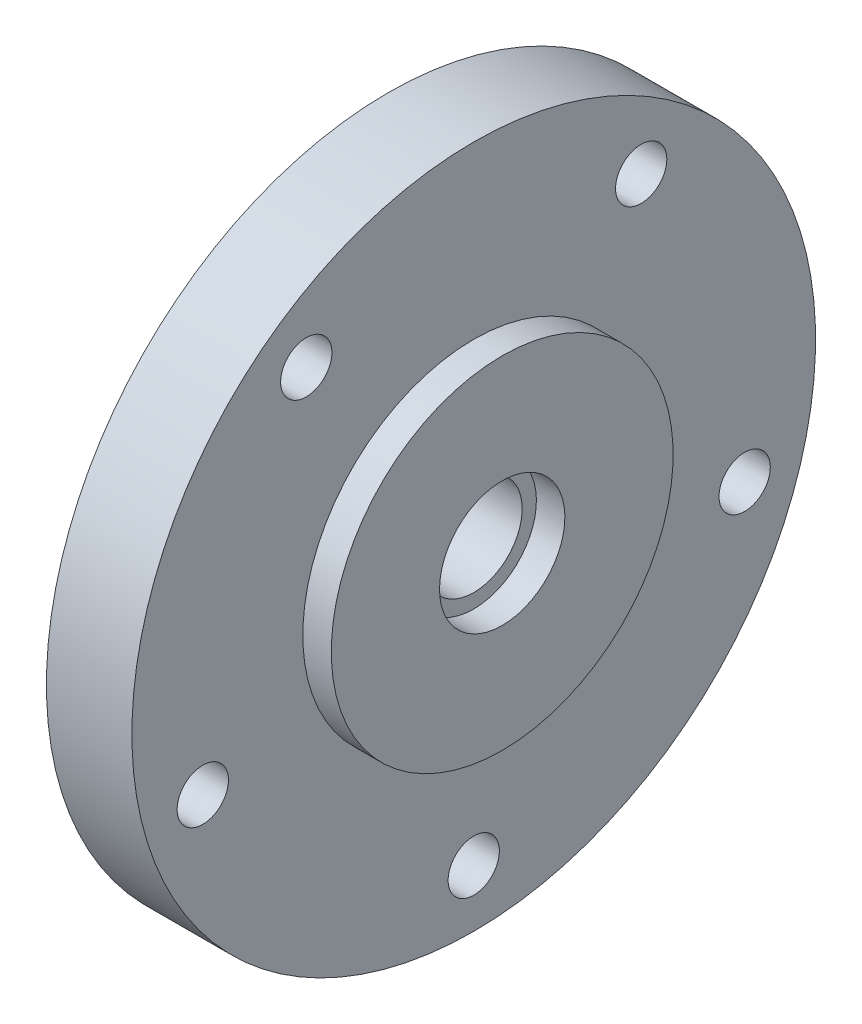
ISO-10303-21;
HEADER;
FILE_DESCRIPTION(('STEP AP214'),'2;1');
FILE_NAME('part.step','',(''),(''),'','','');
FILE_SCHEMA(('AUTOMOTIVE_DESIGN { 1 0 10303 214 1 1 1 1 }'));
ENDSEC;
DATA;
#1=APPLICATION_CONTEXT('core data for automotive mechanical design processes');
#2=APPLICATION_PROTOCOL_DEFINITION('international standard','automotive_design',2000,#1);
#3=PRODUCT_CONTEXT('',#1,'mechanical');
#4=PRODUCT('Part','Part','',(#3));
#5=PRODUCT_RELATED_PRODUCT_CATEGORY('part','',(#4));
#6=PRODUCT_DEFINITION_FORMATION('','',#4);
#7=PRODUCT_DEFINITION_CONTEXT('part definition',#1,'design');
#8=PRODUCT_DEFINITION('design','',#6,#7);
#9=PRODUCT_DEFINITION_SHAPE('','',#8);
#10=(LENGTH_UNIT() NAMED_UNIT(*) SI_UNIT(.MILLI.,.METRE.));
#11=(NAMED_UNIT(*) PLANE_ANGLE_UNIT() SI_UNIT($,.RADIAN.));
#12=(NAMED_UNIT(*) SI_UNIT($,.STERADIAN.) SOLID_ANGLE_UNIT());
#13=UNCERTAINTY_MEASURE_WITH_UNIT(LENGTH_MEASURE(1.E-05),#10,'distance_accuracy_value','');
#14=(GEOMETRIC_REPRESENTATION_CONTEXT(3) GLOBAL_UNCERTAINTY_ASSIGNED_CONTEXT((#13)) GLOBAL_UNIT_ASSIGNED_CONTEXT((#10,
#11,#12)) REPRESENTATION_CONTEXT('',''));
#15=CARTESIAN_POINT('',(0.,0.,0.));
#16=DIRECTION('',(0.,0.,1.));
#17=DIRECTION('',(1.,0.,0.));
#18=AXIS2_PLACEMENT_3D('',#15,#16,#17);
#19=CARTESIAN_POINT('',(-5.,0.,0.));
#20=DIRECTION('',(-1.,0.,0.));
#21=DIRECTION('',(0.,-1.,0.));
#22=AXIS2_PLACEMENT_3D('',#19,#20,#21);
#23=PLANE('',#22);
#24=CARTESIAN_POINT('',(-5.,0.,0.));
#25=DIRECTION('',(-1.,0.,0.));
#26=DIRECTION('',(0.,-1.,0.));
#27=AXIS2_PLACEMENT_3D('',#24,#25,#26);
#28=CIRCLE('',#27,60.);
#29=CARTESIAN_POINT('',(-5.,-60.,0.));
#30=VERTEX_POINT('',#29);
#31=EDGE_CURVE('E66',#30,#30,#28,.T.);
#32=ORIENTED_EDGE('',*,*,#31,.F.);
#33=EDGE_LOOP('',(#32));
#34=FACE_BOUND('',#33,.T.);
#35=CARTESIAN_POINT('',(-5.,0.,0.));
#36=DIRECTION('',(-1.,0.,0.));
#37=DIRECTION('',(0.,-1.,0.));
#38=AXIS2_PLACEMENT_3D('',#35,#36,#37);
#39=CIRCLE('',#38,30.);
#40=CARTESIAN_POINT('',(-5.,-30.,0.));
#41=VERTEX_POINT('',#40);
#42=EDGE_CURVE('E60',#41,#41,#39,.T.);
#43=ORIENTED_EDGE('',*,*,#42,.T.);
#44=EDGE_LOOP('',(#43));
#45=FACE_BOUND('',#44,.T.);
#46=CARTESIAN_POINT('',(-5.,-50.,0.));
#47=DIRECTION('',(1.,0.,0.));
#48=DIRECTION('',(0.,0.,-1.));
#49=AXIS2_PLACEMENT_3D('',#46,#47,#48);
#50=CIRCLE('',#49,4.5);
#51=CARTESIAN_POINT('',(-5.,-50.,-4.5));
#52=VERTEX_POINT('',#51);
#53=EDGE_CURVE('E102',#52,#52,#50,.T.);
#54=ORIENTED_EDGE('',*,*,#53,.F.);
#55=EDGE_LOOP('',(#54));
#56=FACE_BOUND('',#55,.T.);
#57=CARTESIAN_POINT('',(-5.,-15.4508497187472,-47.5528258147577));
#58=DIRECTION('',(1.,0.,0.));
#59=DIRECTION('',(0.,0.,-1.));
#60=AXIS2_PLACEMENT_3D('',#57,#58,#59);
#61=CIRCLE('',#60,4.5);
#62=CARTESIAN_POINT('',(-5.,-15.4508497187472,-52.0528258147577));
#63=VERTEX_POINT('',#62);
#64=EDGE_CURVE('E110',#63,#63,#61,.T.);
#65=ORIENTED_EDGE('',*,*,#64,.F.);
#66=EDGE_LOOP('',(#65));
#67=FACE_BOUND('',#66,.T.);
#68=CARTESIAN_POINT('',(-5.,40.4508497187475,-29.3892626146234));
#69=DIRECTION('',(1.,0.,0.));
#70=DIRECTION('',(0.,0.,-1.));
#71=AXIS2_PLACEMENT_3D('',#68,#69,#70);
#72=CIRCLE('',#71,4.5);
#73=CARTESIAN_POINT('',(-5.,40.4508497187475,-33.8892626146234));
#74=VERTEX_POINT('',#73);
#75=EDGE_CURVE('E118',#74,#74,#72,.T.);
#76=ORIENTED_EDGE('',*,*,#75,.F.);
#77=EDGE_LOOP('',(#76));
#78=FACE_BOUND('',#77,.T.);
#79=CARTESIAN_POINT('',(-5.,40.4508497187471,29.389262614624));
#80=DIRECTION('',(1.,0.,0.));
#81=DIRECTION('',(0.,0.,-1.));
#82=AXIS2_PLACEMENT_3D('',#79,#80,#81);
#83=CIRCLE('',#82,4.5);
#84=CARTESIAN_POINT('',(-5.,40.4508497187471,24.889262614624));
#85=VERTEX_POINT('',#84);
#86=EDGE_CURVE('E126',#85,#85,#83,.T.);
#87=ORIENTED_EDGE('',*,*,#86,.F.);
#88=EDGE_LOOP('',(#87));
#89=FACE_BOUND('',#88,.T.);
#90=CARTESIAN_POINT('',(-5.,-15.4508497187479,47.5528258147575));
#91=DIRECTION('',(1.,0.,0.));
#92=DIRECTION('',(0.,0.,-1.));
#93=AXIS2_PLACEMENT_3D('',#90,#91,#92);
#94=CIRCLE('',#93,4.5);
#95=CARTESIAN_POINT('',(-5.,-15.4508497187479,43.0528258147575));
#96=VERTEX_POINT('',#95);
#97=EDGE_CURVE('E134',#96,#96,#94,.T.);
#98=ORIENTED_EDGE('',*,*,#97,.F.);
#99=EDGE_LOOP('',(#98));
#100=FACE_BOUND('',#99,.T.);
#101=ADVANCED_FACE('F40',(#34,#45,#56,#67,#78,#89,#100),#23,.F.);
#102=CARTESIAN_POINT('',(-5.,0.,0.));
#103=DIRECTION('',(-1.,0.,0.));
#104=DIRECTION('',(0.,-1.,0.));
#105=AXIS2_PLACEMENT_3D('',#102,#103,#104);
#106=PLANE('',#105);
#107=CARTESIAN_POINT('',(-5.,0.,0.));
#108=DIRECTION('',(-1.,0.,0.));
#109=DIRECTION('',(0.,-1.,0.));
#110=AXIS2_PLACEMENT_3D('',#107,#108,#109);
#111=CIRCLE('',#110,11.);
#112=CARTESIAN_POINT('',(-5.,-11.,0.));
#113=VERTEX_POINT('',#112);
#114=EDGE_CURVE('E10',#113,#113,#111,.T.);
#115=ORIENTED_EDGE('',*,*,#114,.F.);
#116=EDGE_LOOP('',(#115));
#117=FACE_BOUND('',#116,.T.);
#118=CARTESIAN_POINT('',(-5.,0.,0.));
#119=DIRECTION('',(-1.,0.,0.));
#120=DIRECTION('',(0.,-1.,0.));
#121=AXIS2_PLACEMENT_3D('',#118,#119,#120);
#122=CIRCLE('',#121,8.5);
#123=CARTESIAN_POINT('',(-5.,-8.5,0.));
#124=VERTEX_POINT('',#123);
#125=EDGE_CURVE('E94',#124,#124,#122,.T.);
#126=ORIENTED_EDGE('',*,*,#125,.T.);
#127=EDGE_LOOP('',(#126));
#128=FACE_BOUND('',#127,.T.);
#129=ADVANCED_FACE('F42',(#117,#128),#106,.F.);
#130=CARTESIAN_POINT('',(-20.,0.,0.));
#131=DIRECTION('',(-1.,0.,0.));
#132=DIRECTION('',(0.,-1.,0.));
#133=AXIS2_PLACEMENT_3D('',#130,#131,#132);
#134=CYLINDRICAL_SURFACE('',#133,11.);
#135=CARTESIAN_POINT('',(0.,0.,0.));
#136=DIRECTION('',(-1.,0.,0.));
#137=DIRECTION('',(0.,-1.,0.));
#138=AXIS2_PLACEMENT_3D('',#135,#136,#137);
#139=CIRCLE('',#138,11.);
#140=CARTESIAN_POINT('',(0.,-11.,0.));
#141=VERTEX_POINT('',#140);
#142=EDGE_CURVE('E48',#141,#141,#139,.T.);
#143=ORIENTED_EDGE('',*,*,#142,.F.);
#144=EDGE_LOOP('',(#143));
#145=FACE_BOUND('',#144,.T.);
#146=ORIENTED_EDGE('',*,*,#114,.T.);
#147=EDGE_LOOP('',(#146));
#148=FACE_BOUND('',#147,.T.);
#149=ADVANCED_FACE('F149',(#145,#148),#134,.F.);
#150=CARTESIAN_POINT('',(0.,0.,0.));
#151=DIRECTION('',(-1.,0.,0.));
#152=DIRECTION('',(0.,-1.,0.));
#153=AXIS2_PLACEMENT_3D('',#150,#151,#152);
#154=PLANE('',#153);
#155=CARTESIAN_POINT('',(0.,0.,0.));
#156=DIRECTION('',(-1.,0.,0.));
#157=DIRECTION('',(0.,-1.,0.));
#158=AXIS2_PLACEMENT_3D('',#155,#156,#157);
#159=CIRCLE('',#158,30.);
#160=CARTESIAN_POINT('',(0.,-30.,0.));
#161=VERTEX_POINT('',#160);
#162=EDGE_CURVE('E54',#161,#161,#159,.T.);
#163=ORIENTED_EDGE('',*,*,#162,.F.);
#164=EDGE_LOOP('',(#163));
#165=FACE_BOUND('',#164,.T.);
#166=ORIENTED_EDGE('',*,*,#142,.T.);
#167=EDGE_LOOP('',(#166));
#168=FACE_BOUND('',#167,.T.);
#169=ADVANCED_FACE('F160',(#165,#168),#154,.F.);
#170=CARTESIAN_POINT('',(-20.,0.,0.));
#171=DIRECTION('',(-1.,0.,0.));
#172=DIRECTION('',(0.,-1.,0.));
#173=AXIS2_PLACEMENT_3D('',#170,#171,#172);
#174=CYLINDRICAL_SURFACE('',#173,30.);
#175=ORIENTED_EDGE('',*,*,#42,.F.);
#176=EDGE_LOOP('',(#175));
#177=FACE_BOUND('',#176,.T.);
#178=ORIENTED_EDGE('',*,*,#162,.T.);
#179=EDGE_LOOP('',(#178));
#180=FACE_BOUND('',#179,.T.);
#181=ADVANCED_FACE('F157',(#177,#180),#174,.T.);
#182=CARTESIAN_POINT('',(-20.,0.,0.));
#183=DIRECTION('',(-1.,0.,0.));
#184=DIRECTION('',(0.,-1.,0.));
#185=AXIS2_PLACEMENT_3D('',#182,#183,#184);
#186=CYLINDRICAL_SURFACE('',#185,60.);
#187=ORIENTED_EDGE('',*,*,#31,.T.);
#188=EDGE_LOOP('',(#187));
#189=FACE_BOUND('',#188,.T.);
#190=CARTESIAN_POINT('',(-20.,0.,0.));
#191=DIRECTION('',(-1.,0.,0.));
#192=DIRECTION('',(0.,-1.,0.));
#193=AXIS2_PLACEMENT_3D('',#190,#191,#192);
#194=CIRCLE('',#193,60.);
#195=CARTESIAN_POINT('',(-20.,-60.,0.));
#196=VERTEX_POINT('',#195);
#197=EDGE_CURVE('E70',#196,#196,#194,.T.);
#198=ORIENTED_EDGE('',*,*,#197,.F.);
#199=EDGE_LOOP('',(#198));
#200=FACE_BOUND('',#199,.T.);
#201=ADVANCED_FACE('F155',(#189,#200),#186,.T.);
#202=CARTESIAN_POINT('',(-20.,0.,0.));
#203=DIRECTION('',(-1.,0.,0.));
#204=DIRECTION('',(0.,-1.,0.));
#205=AXIS2_PLACEMENT_3D('',#202,#203,#204);
#206=PLANE('',#205);
#207=CARTESIAN_POINT('',(-20.,-15.4508497187479,47.5528258147575));
#208=DIRECTION('',(-1.,0.,0.));
#209=DIRECTION('',(0.,-1.,0.));
#210=AXIS2_PLACEMENT_3D('',#207,#208,#209);
#211=CIRCLE('',#210,4.5);
#212=CARTESIAN_POINT('',(-20.,-19.9508497187479,47.5528258147575));
#213=VERTEX_POINT('',#212);
#214=EDGE_CURVE('E130',#213,#213,#211,.T.);
#215=ORIENTED_EDGE('',*,*,#214,.F.);
#216=EDGE_LOOP('',(#215));
#217=FACE_BOUND('',#216,.T.);
#218=CARTESIAN_POINT('',(-20.,40.4508497187471,29.389262614624));
#219=DIRECTION('',(-1.,0.,0.));
#220=DIRECTION('',(0.,-1.,0.));
#221=AXIS2_PLACEMENT_3D('',#218,#219,#220);
#222=CIRCLE('',#221,4.5);
#223=CARTESIAN_POINT('',(-20.,35.9508497187471,29.389262614624));
#224=VERTEX_POINT('',#223);
#225=EDGE_CURVE('E122',#224,#224,#222,.T.);
#226=ORIENTED_EDGE('',*,*,#225,.F.);
#227=EDGE_LOOP('',(#226));
#228=FACE_BOUND('',#227,.T.);
#229=CARTESIAN_POINT('',(-20.,40.4508497187475,-29.3892626146234));
#230=DIRECTION('',(-1.,0.,0.));
#231=DIRECTION('',(0.,-1.,0.));
#232=AXIS2_PLACEMENT_3D('',#229,#230,#231);
#233=CIRCLE('',#232,4.5);
#234=CARTESIAN_POINT('',(-20.,35.9508497187475,-29.3892626146234));
#235=VERTEX_POINT('',#234);
#236=EDGE_CURVE('E114',#235,#235,#233,.T.);
#237=ORIENTED_EDGE('',*,*,#236,.F.);
#238=EDGE_LOOP('',(#237));
#239=FACE_BOUND('',#238,.T.);
#240=CARTESIAN_POINT('',(-20.,-15.4508497187472,-47.5528258147577));
#241=DIRECTION('',(-1.,0.,0.));
#242=DIRECTION('',(0.,-1.,0.));
#243=AXIS2_PLACEMENT_3D('',#240,#241,#242);
#244=CIRCLE('',#243,4.5);
#245=CARTESIAN_POINT('',(-20.,-19.9508497187472,-47.5528258147577));
#246=VERTEX_POINT('',#245);
#247=EDGE_CURVE('E106',#246,#246,#244,.T.);
#248=ORIENTED_EDGE('',*,*,#247,.F.);
#249=EDGE_LOOP('',(#248));
#250=FACE_BOUND('',#249,.T.);
#251=CARTESIAN_POINT('',(-20.,-50.,0.));
#252=DIRECTION('',(-1.,0.,0.));
#253=DIRECTION('',(0.,-1.,0.));
#254=AXIS2_PLACEMENT_3D('',#251,#252,#253);
#255=CIRCLE('',#254,4.5);
#256=CARTESIAN_POINT('',(-20.,-54.5,0.));
#257=VERTEX_POINT('',#256);
#258=EDGE_CURVE('E98',#257,#257,#255,.T.);
#259=ORIENTED_EDGE('',*,*,#258,.F.);
#260=EDGE_LOOP('',(#259));
#261=FACE_BOUND('',#260,.T.);
#262=ORIENTED_EDGE('',*,*,#197,.T.);
#263=EDGE_LOOP('',(#262));
#264=FACE_BOUND('',#263,.T.);
#265=CARTESIAN_POINT('',(-20.,0.,0.));
#266=DIRECTION('',(-1.,0.,0.));
#267=DIRECTION('',(0.,-1.,0.));
#268=AXIS2_PLACEMENT_3D('',#265,#266,#267);
#269=CIRCLE('',#268,40.);
#270=CARTESIAN_POINT('',(-20.,-40.,0.));
#271=VERTEX_POINT('',#270);
#272=EDGE_CURVE('E74',#271,#271,#269,.T.);
#273=ORIENTED_EDGE('',*,*,#272,.F.);
#274=EDGE_LOOP('',(#273));
#275=FACE_BOUND('',#274,.T.);
#276=ADVANCED_FACE('F184',(#217,#228,#239,#250,#261,#264,#275),#206,.T.);
#277=CARTESIAN_POINT('',(-20.,0.,0.));
#278=DIRECTION('',(-1.,0.,0.));
#279=DIRECTION('',(0.,-1.,0.));
#280=AXIS2_PLACEMENT_3D('',#277,#278,#279);
#281=CYLINDRICAL_SURFACE('',#280,40.);
#282=ORIENTED_EDGE('',*,*,#272,.T.);
#283=EDGE_LOOP('',(#282));
#284=FACE_BOUND('',#283,.T.);
#285=CARTESIAN_POINT('',(-10.,0.,0.));
#286=DIRECTION('',(-1.,0.,0.));
#287=DIRECTION('',(0.,-1.,0.));
#288=AXIS2_PLACEMENT_3D('',#285,#286,#287);
#289=CIRCLE('',#288,40.);
#290=CARTESIAN_POINT('',(-10.,-40.,0.));
#291=VERTEX_POINT('',#290);
#292=EDGE_CURVE('E78',#291,#291,#289,.T.);
#293=ORIENTED_EDGE('',*,*,#292,.F.);
#294=EDGE_LOOP('',(#293));
#295=FACE_BOUND('',#294,.T.);
#296=ADVANCED_FACE('F191',(#284,#295),#281,.F.);
#297=CARTESIAN_POINT('',(-10.,0.,0.));
#298=DIRECTION('',(-1.,0.,0.));
#299=DIRECTION('',(0.,-1.,0.));
#300=AXIS2_PLACEMENT_3D('',#297,#298,#299);
#301=PLANE('',#300);
#302=ORIENTED_EDGE('',*,*,#292,.T.);
#303=EDGE_LOOP('',(#302));
#304=FACE_BOUND('',#303,.T.);
#305=CARTESIAN_POINT('',(-10.,0.,0.));
#306=DIRECTION('',(-1.,0.,0.));
#307=DIRECTION('',(0.,-1.,0.));
#308=AXIS2_PLACEMENT_3D('',#305,#306,#307);
#309=CIRCLE('',#308,12.5);
#310=CARTESIAN_POINT('',(-10.,-12.5,0.));
#311=VERTEX_POINT('',#310);
#312=EDGE_CURVE('E82',#311,#311,#309,.T.);
#313=ORIENTED_EDGE('',*,*,#312,.F.);
#314=EDGE_LOOP('',(#313));
#315=FACE_BOUND('',#314,.T.);
#316=ADVANCED_FACE('F198',(#304,#315),#301,.T.);
#317=CARTESIAN_POINT('',(-20.,0.,0.));
#318=DIRECTION('',(-1.,0.,0.));
#319=DIRECTION('',(0.,-1.,0.));
#320=AXIS2_PLACEMENT_3D('',#317,#318,#319);
#321=CYLINDRICAL_SURFACE('',#320,12.5);
#322=ORIENTED_EDGE('',*,*,#312,.T.);
#323=EDGE_LOOP('',(#322));
#324=FACE_BOUND('',#323,.T.);
#325=CARTESIAN_POINT('',(-20.,0.,0.));
#326=DIRECTION('',(-1.,0.,0.));
#327=DIRECTION('',(0.,-1.,0.));
#328=AXIS2_PLACEMENT_3D('',#325,#326,#327);
#329=CIRCLE('',#328,12.5);
#330=CARTESIAN_POINT('',(-20.,-12.5,0.));
#331=VERTEX_POINT('',#330);
#332=EDGE_CURVE('E86',#331,#331,#329,.T.);
#333=ORIENTED_EDGE('',*,*,#332,.F.);
#334=EDGE_LOOP('',(#333));
#335=FACE_BOUND('',#334,.T.);
#336=ADVANCED_FACE('F206',(#324,#335),#321,.T.);
#337=CARTESIAN_POINT('',(-20.,0.,0.));
#338=DIRECTION('',(1.,0.,0.));
#339=DIRECTION('',(0.,1.,0.));
#340=AXIS2_PLACEMENT_3D('',#337,#338,#339);
#341=PLANE('',#340);
#342=CARTESIAN_POINT('',(-20.,0.,0.));
#343=DIRECTION('',(-1.,0.,0.));
#344=DIRECTION('',(0.,-1.,0.));
#345=AXIS2_PLACEMENT_3D('',#342,#343,#344);
#346=CIRCLE('',#345,8.5);
#347=CARTESIAN_POINT('',(-20.,-8.5,0.));
#348=VERTEX_POINT('',#347);
#349=EDGE_CURVE('E90',#348,#348,#346,.T.);
#350=ORIENTED_EDGE('',*,*,#349,.F.);
#351=EDGE_LOOP('',(#350));
#352=FACE_BOUND('',#351,.T.);
#353=ORIENTED_EDGE('',*,*,#332,.T.);
#354=EDGE_LOOP('',(#353));
#355=FACE_BOUND('',#354,.T.);
#356=ADVANCED_FACE('F214',(#352,#355),#341,.F.);
#357=CARTESIAN_POINT('',(-20.,0.,0.));
#358=DIRECTION('',(-1.,0.,0.));
#359=DIRECTION('',(0.,-1.,0.));
#360=AXIS2_PLACEMENT_3D('',#357,#358,#359);
#361=CYLINDRICAL_SURFACE('',#360,8.5);
#362=ORIENTED_EDGE('',*,*,#125,.F.);
#363=EDGE_LOOP('',(#362));
#364=FACE_BOUND('',#363,.T.);
#365=ORIENTED_EDGE('',*,*,#349,.T.);
#366=EDGE_LOOP('',(#365));
#367=FACE_BOUND('',#366,.T.);
#368=ADVANCED_FACE('F222',(#364,#367),#361,.F.);
#369=CARTESIAN_POINT('',(-5.,-50.,0.));
#370=DIRECTION('',(1.,0.,0.));
#371=DIRECTION('',(0.,0.,-1.));
#372=AXIS2_PLACEMENT_3D('',#369,#370,#371);
#373=CYLINDRICAL_SURFACE('',#372,4.5);
#374=ORIENTED_EDGE('',*,*,#53,.T.);
#375=EDGE_LOOP('',(#374));
#376=FACE_BOUND('',#375,.T.);
#377=ORIENTED_EDGE('',*,*,#258,.T.);
#378=EDGE_LOOP('',(#377));
#379=FACE_BOUND('',#378,.T.);
#380=ADVANCED_FACE('F230',(#376,#379),#373,.F.);
#381=CARTESIAN_POINT('',(-5.,-15.4508497187472,-47.5528258147577));
#382=DIRECTION('',(1.,0.,0.));
#383=DIRECTION('',(0.,0.,-1.));
#384=AXIS2_PLACEMENT_3D('',#381,#382,#383);
#385=CYLINDRICAL_SURFACE('',#384,4.5);
#386=ORIENTED_EDGE('',*,*,#64,.T.);
#387=EDGE_LOOP('',(#386));
#388=FACE_BOUND('',#387,.T.);
#389=ORIENTED_EDGE('',*,*,#247,.T.);
#390=EDGE_LOOP('',(#389));
#391=FACE_BOUND('',#390,.T.);
#392=ADVANCED_FACE('F238',(#388,#391),#385,.F.);
#393=CARTESIAN_POINT('',(-5.,40.4508497187475,-29.3892626146234));
#394=DIRECTION('',(1.,0.,0.));
#395=DIRECTION('',(0.,0.,-1.));
#396=AXIS2_PLACEMENT_3D('',#393,#394,#395);
#397=CYLINDRICAL_SURFACE('',#396,4.5);
#398=ORIENTED_EDGE('',*,*,#75,.T.);
#399=EDGE_LOOP('',(#398));
#400=FACE_BOUND('',#399,.T.);
#401=ORIENTED_EDGE('',*,*,#236,.T.);
#402=EDGE_LOOP('',(#401));
#403=FACE_BOUND('',#402,.T.);
#404=ADVANCED_FACE('F246',(#400,#403),#397,.F.);
#405=CARTESIAN_POINT('',(-5.,40.4508497187471,29.389262614624));
#406=DIRECTION('',(1.,0.,0.));
#407=DIRECTION('',(0.,0.,-1.));
#408=AXIS2_PLACEMENT_3D('',#405,#406,#407);
#409=CYLINDRICAL_SURFACE('',#408,4.5);
#410=ORIENTED_EDGE('',*,*,#86,.T.);
#411=EDGE_LOOP('',(#410));
#412=FACE_BOUND('',#411,.T.);
#413=ORIENTED_EDGE('',*,*,#225,.T.);
#414=EDGE_LOOP('',(#413));
#415=FACE_BOUND('',#414,.T.);
#416=ADVANCED_FACE('F254',(#412,#415),#409,.F.);
#417=CARTESIAN_POINT('',(-5.,-15.4508497187479,47.5528258147575));
#418=DIRECTION('',(1.,0.,0.));
#419=DIRECTION('',(0.,0.,-1.));
#420=AXIS2_PLACEMENT_3D('',#417,#418,#419);
#421=CYLINDRICAL_SURFACE('',#420,4.5);
#422=ORIENTED_EDGE('',*,*,#97,.T.);
#423=EDGE_LOOP('',(#422));
#424=FACE_BOUND('',#423,.T.);
#425=ORIENTED_EDGE('',*,*,#214,.T.);
#426=EDGE_LOOP('',(#425));
#427=FACE_BOUND('',#426,.T.);
#428=ADVANCED_FACE('F140',(#424,#427),#421,.F.);
#429=CLOSED_SHELL('',(#101,#129,#149,#169,#181,#201,#276,#296,#316,#336,#356,#368,#380,#392,
#404,#416,#428));
#430=MANIFOLD_SOLID_BREP('B2',#429);
#431=ADVANCED_BREP_SHAPE_REPRESENTATION('',(#18,#430),#14);
#432=SHAPE_DEFINITION_REPRESENTATION(#9,#431);
ENDSEC;
END-ISO-10303-21;
